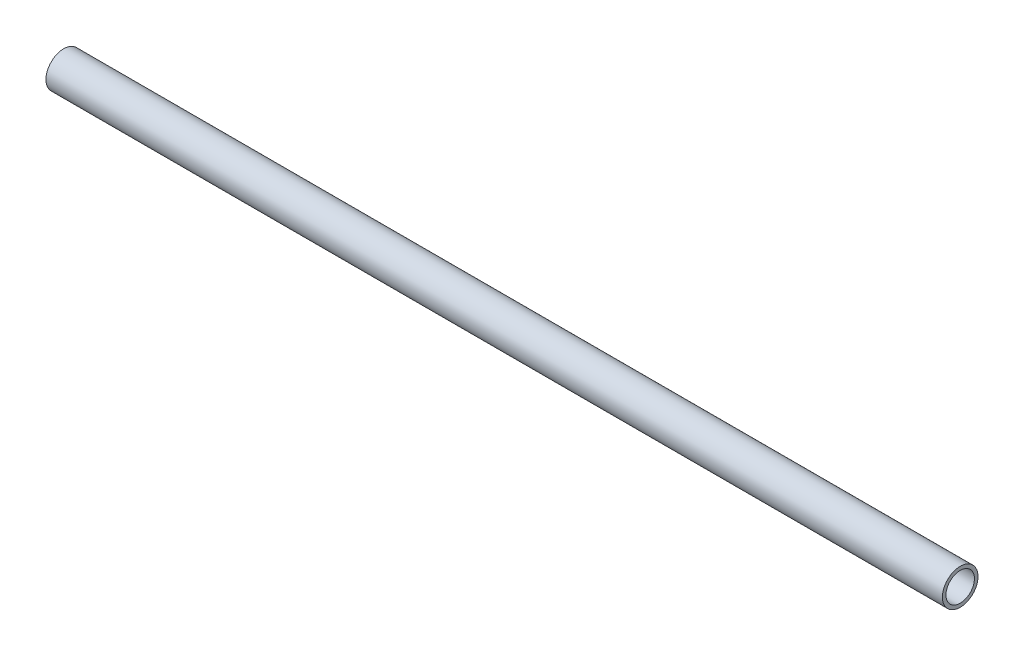
ISO-10303-21;
HEADER;
FILE_DESCRIPTION(('STEP AP214'),'2;1');
FILE_NAME('part.step','',(''),(''),'','','');
FILE_SCHEMA(('AUTOMOTIVE_DESIGN { 1 0 10303 214 1 1 1 1 }'));
ENDSEC;
DATA;
#1=APPLICATION_CONTEXT('core data for automotive mechanical design processes');
#2=APPLICATION_PROTOCOL_DEFINITION('international standard','automotive_design',2000,#1);
#3=PRODUCT_CONTEXT('',#1,'mechanical');
#4=PRODUCT('Part','Part','',(#3));
#5=PRODUCT_RELATED_PRODUCT_CATEGORY('part','',(#4));
#6=PRODUCT_DEFINITION_FORMATION('','',#4);
#7=PRODUCT_DEFINITION_CONTEXT('part definition',#1,'design');
#8=PRODUCT_DEFINITION('design','',#6,#7);
#9=PRODUCT_DEFINITION_SHAPE('','',#8);
#10=(LENGTH_UNIT() NAMED_UNIT(*) SI_UNIT(.MILLI.,.METRE.));
#11=(NAMED_UNIT(*) PLANE_ANGLE_UNIT() SI_UNIT($,.RADIAN.));
#12=(NAMED_UNIT(*) SI_UNIT($,.STERADIAN.) SOLID_ANGLE_UNIT());
#13=UNCERTAINTY_MEASURE_WITH_UNIT(LENGTH_MEASURE(1.E-05),#10,'distance_accuracy_value','');
#14=(GEOMETRIC_REPRESENTATION_CONTEXT(3) GLOBAL_UNCERTAINTY_ASSIGNED_CONTEXT((#13)) GLOBAL_UNIT_ASSIGNED_CONTEXT((#10,
#11,#12)) REPRESENTATION_CONTEXT('',''));
#15=CARTESIAN_POINT('',(0.,0.,0.));
#16=DIRECTION('',(0.,0.,1.));
#17=DIRECTION('',(1.,0.,0.));
#18=AXIS2_PLACEMENT_3D('',#15,#16,#17);
#19=CARTESIAN_POINT('',(126.,0.,0.));
#20=DIRECTION('',(1.,0.,0.));
#21=DIRECTION('',(0.,0.,-1.));
#22=AXIS2_PLACEMENT_3D('',#19,#20,#21);
#23=PLANE('',#22);
#24=CARTESIAN_POINT('',(126.,0.,0.));
#25=DIRECTION('',(1.,0.,0.));
#26=DIRECTION('',(0.,0.,-1.));
#27=AXIS2_PLACEMENT_3D('',#24,#25,#26);
#28=CIRCLE('',#27,5.);
#29=CARTESIAN_POINT('',(126.,0.,-5.));
#30=VERTEX_POINT('',#29);
#31=EDGE_CURVE('E10',#30,#30,#28,.T.);
#32=ORIENTED_EDGE('',*,*,#31,.T.);
#33=EDGE_LOOP('',(#32));
#34=FACE_BOUND('',#33,.T.);
#35=CARTESIAN_POINT('',(126.,0.,0.));
#36=DIRECTION('',(1.,0.,0.));
#37=DIRECTION('',(0.,0.,-1.));
#38=AXIS2_PLACEMENT_3D('',#35,#36,#37);
#39=CIRCLE('',#38,4.);
#40=CARTESIAN_POINT('',(126.,0.,-4.));
#41=VERTEX_POINT('',#40);
#42=EDGE_CURVE('E44',#41,#41,#39,.T.);
#43=ORIENTED_EDGE('',*,*,#42,.F.);
#44=EDGE_LOOP('',(#43));
#45=FACE_BOUND('',#44,.T.);
#46=ADVANCED_FACE('F33',(#34,#45),#23,.T.);
#47=CARTESIAN_POINT('',(-126.,0.,0.));
#48=DIRECTION('',(1.,0.,0.));
#49=DIRECTION('',(0.,0.,-1.));
#50=AXIS2_PLACEMENT_3D('',#47,#48,#49);
#51=PLANE('',#50);
#52=CARTESIAN_POINT('',(-126.,0.,0.));
#53=DIRECTION('',(1.,0.,0.));
#54=DIRECTION('',(0.,0.,-1.));
#55=AXIS2_PLACEMENT_3D('',#52,#53,#54);
#56=CIRCLE('',#55,5.);
#57=CARTESIAN_POINT('',(-126.,0.,-5.));
#58=VERTEX_POINT('',#57);
#59=EDGE_CURVE('E37',#58,#58,#56,.T.);
#60=ORIENTED_EDGE('',*,*,#59,.F.);
#61=EDGE_LOOP('',(#60));
#62=FACE_BOUND('',#61,.T.);
#63=CARTESIAN_POINT('',(-126.,0.,0.));
#64=DIRECTION('',(1.,0.,0.));
#65=DIRECTION('',(0.,0.,-1.));
#66=AXIS2_PLACEMENT_3D('',#63,#64,#65);
#67=CIRCLE('',#66,4.);
#68=CARTESIAN_POINT('',(-126.,0.,-4.));
#69=VERTEX_POINT('',#68);
#70=EDGE_CURVE('E46',#69,#69,#67,.T.);
#71=ORIENTED_EDGE('',*,*,#70,.T.);
#72=EDGE_LOOP('',(#71));
#73=FACE_BOUND('',#72,.T.);
#74=ADVANCED_FACE('F56',(#62,#73),#51,.F.);
#75=CARTESIAN_POINT('',(126.,0.,0.));
#76=DIRECTION('',(-1.,0.,0.));
#77=DIRECTION('',(0.,0.,1.));
#78=AXIS2_PLACEMENT_3D('',#75,#76,#77);
#79=CYLINDRICAL_SURFACE('',#78,5.);
#80=ORIENTED_EDGE('',*,*,#31,.F.);
#81=EDGE_LOOP('',(#80));
#82=FACE_BOUND('',#81,.T.);
#83=ORIENTED_EDGE('',*,*,#59,.T.);
#84=EDGE_LOOP('',(#83));
#85=FACE_BOUND('',#84,.T.);
#86=ADVANCED_FACE('F35',(#82,#85),#79,.T.);
#87=CARTESIAN_POINT('',(126.,0.,0.));
#88=DIRECTION('',(-1.,0.,0.));
#89=DIRECTION('',(0.,0.,1.));
#90=AXIS2_PLACEMENT_3D('',#87,#88,#89);
#91=CYLINDRICAL_SURFACE('',#90,4.);
#92=ORIENTED_EDGE('',*,*,#42,.T.);
#93=EDGE_LOOP('',(#92));
#94=FACE_BOUND('',#93,.T.);
#95=ORIENTED_EDGE('',*,*,#70,.F.);
#96=EDGE_LOOP('',(#95));
#97=FACE_BOUND('',#96,.T.);
#98=ADVANCED_FACE('F52',(#94,#97),#91,.F.);
#99=CLOSED_SHELL('',(#46,#74,#86,#98));
#100=MANIFOLD_SOLID_BREP('B2',#99);
#101=ADVANCED_BREP_SHAPE_REPRESENTATION('',(#18,#100),#14);
#102=SHAPE_DEFINITION_REPRESENTATION(#9,#101);
ENDSEC;
END-ISO-10303-21;
